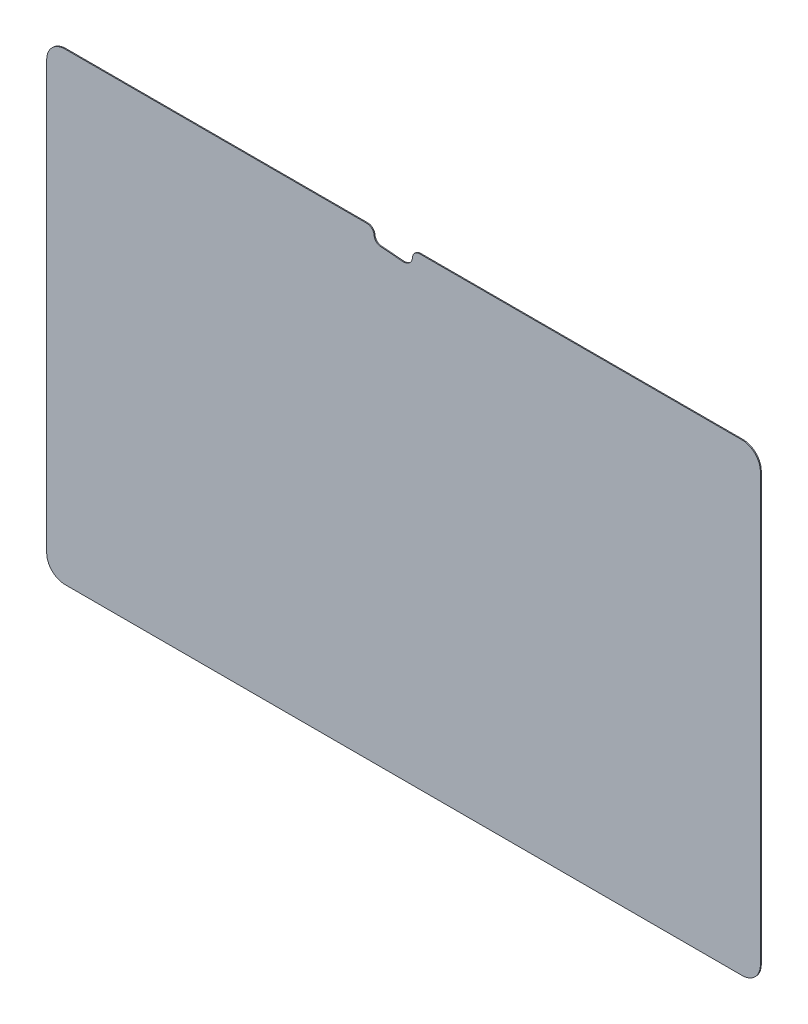
ISO-10303-21;
HEADER;
FILE_DESCRIPTION(('STEP AP214'),'2;1');
FILE_NAME('part.step','',(''),(''),'','','');
FILE_SCHEMA(('AUTOMOTIVE_DESIGN { 1 0 10303 214 1 1 1 1 }'));
ENDSEC;
DATA;
#1=APPLICATION_CONTEXT('core data for automotive mechanical design processes');
#2=APPLICATION_PROTOCOL_DEFINITION('international standard','automotive_design',2000,#1);
#3=PRODUCT_CONTEXT('',#1,'mechanical');
#4=PRODUCT('Part','Part','',(#3));
#5=PRODUCT_RELATED_PRODUCT_CATEGORY('part','',(#4));
#6=PRODUCT_DEFINITION_FORMATION('','',#4);
#7=PRODUCT_DEFINITION_CONTEXT('part definition',#1,'design');
#8=PRODUCT_DEFINITION('design','',#6,#7);
#9=PRODUCT_DEFINITION_SHAPE('','',#8);
#10=(LENGTH_UNIT() NAMED_UNIT(*) SI_UNIT(.MILLI.,.METRE.));
#11=(NAMED_UNIT(*) PLANE_ANGLE_UNIT() SI_UNIT($,.RADIAN.));
#12=(NAMED_UNIT(*) SI_UNIT($,.STERADIAN.) SOLID_ANGLE_UNIT());
#13=UNCERTAINTY_MEASURE_WITH_UNIT(LENGTH_MEASURE(1.E-05),#10,'distance_accuracy_value','');
#14=(GEOMETRIC_REPRESENTATION_CONTEXT(3) GLOBAL_UNCERTAINTY_ASSIGNED_CONTEXT((#13)) GLOBAL_UNIT_ASSIGNED_CONTEXT((#10,
#11,#12)) REPRESENTATION_CONTEXT('',''));
#15=CARTESIAN_POINT('',(0.,0.,0.));
#16=DIRECTION('',(0.,0.,1.));
#17=DIRECTION('',(1.,0.,0.));
#18=AXIS2_PLACEMENT_3D('',#15,#16,#17);
#19=CARTESIAN_POINT('',(126.0094,81.8896,0.3302));
#20=DIRECTION('',(0.,-1.,0.));
#21=DIRECTION('',(1.,0.,0.));
#22=AXIS2_PLACEMENT_3D('',#19,#20,#21);
#23=PLANE('',#22);
#24=DIRECTION('',(-1.,0.,0.));
#25=VECTOR('',#24,1.);
#26=CARTESIAN_POINT('',(126.0094,81.8896,0.));
#27=LINE('',#26,#25);
#28=CARTESIAN_POINT('',(119.5578,81.8896,0.));
#29=VERTEX_POINT('',#28);
#30=CARTESIAN_POINT('',(5.70229044401534,81.8896,0.));
#31=VERTEX_POINT('',#30);
#32=EDGE_CURVE('E172',#29,#31,#27,.T.);
#33=ORIENTED_EDGE('',*,*,#32,.T.);
#34=DIRECTION('',(0.,0.,1.));
#35=VECTOR('',#34,1.);
#36=CARTESIAN_POINT('',(5.70229044401534,81.8896,0.3302));
#37=LINE('',#36,#35);
#38=CARTESIAN_POINT('',(5.70229044401534,81.8896,0.3302));
#39=VERTEX_POINT('',#38);
#40=EDGE_CURVE('E230',#31,#39,#37,.T.);
#41=ORIENTED_EDGE('',*,*,#40,.T.);
#42=DIRECTION('',(-1.,0.,0.));
#43=VECTOR('',#42,1.);
#44=CARTESIAN_POINT('',(126.0094,81.8896,0.3302));
#45=LINE('',#44,#43);
#46=CARTESIAN_POINT('',(119.5578,81.8896,0.3302));
#47=VERTEX_POINT('',#46);
#48=EDGE_CURVE('E179',#47,#39,#45,.T.);
#49=ORIENTED_EDGE('',*,*,#48,.F.);
#50=DIRECTION('',(0.,0.,-1.));
#51=VECTOR('',#50,1.);
#52=CARTESIAN_POINT('',(119.5578,81.8896,0.3302));
#53=LINE('',#52,#51);
#54=EDGE_CURVE('E195',#47,#29,#53,.T.);
#55=ORIENTED_EDGE('',*,*,#54,.T.);
#56=EDGE_LOOP('',(#33,#41,#49,#55));
#57=FACE_BOUND('',#56,.T.);
#58=ADVANCED_FACE('F39',(#57),#23,.F.);
#59=CARTESIAN_POINT('',(-126.0094,-81.8896,0.3302));
#60=DIRECTION('',(1.,0.,0.));
#61=DIRECTION('',(0.,0.,-1.));
#62=AXIS2_PLACEMENT_3D('',#59,#60,#61);
#63=PLANE('',#62);
#64=DIRECTION('',(0.,-1.,0.));
#65=VECTOR('',#64,1.);
#66=CARTESIAN_POINT('',(-126.0094,-81.8896,0.));
#67=LINE('',#66,#65);
#68=CARTESIAN_POINT('',(-126.0094,75.4379999999999,0.));
#69=VERTEX_POINT('',#68);
#70=CARTESIAN_POINT('',(-126.0094,-75.438,0.));
#71=VERTEX_POINT('',#70);
#72=EDGE_CURVE('E166',#69,#71,#67,.T.);
#73=ORIENTED_EDGE('',*,*,#72,.T.);
#74=DIRECTION('',(0.,0.,-1.));
#75=VECTOR('',#74,1.);
#76=CARTESIAN_POINT('',(-126.0094,-75.438,0.3302));
#77=LINE('',#76,#75);
#78=CARTESIAN_POINT('',(-126.0094,-75.438,0.3302));
#79=VERTEX_POINT('',#78);
#80=EDGE_CURVE('E228',#71,#79,#77,.F.);
#81=ORIENTED_EDGE('',*,*,#80,.T.);
#82=DIRECTION('',(0.,-1.,0.));
#83=VECTOR('',#82,1.);
#84=CARTESIAN_POINT('',(-126.0094,-81.8896,0.3302));
#85=LINE('',#84,#83);
#86=CARTESIAN_POINT('',(-126.0094,75.4379999999999,0.3302));
#87=VERTEX_POINT('',#86);
#88=EDGE_CURVE('E168',#87,#79,#85,.T.);
#89=ORIENTED_EDGE('',*,*,#88,.F.);
#90=DIRECTION('',(0.,0.,-1.));
#91=VECTOR('',#90,1.);
#92=CARTESIAN_POINT('',(-126.0094,75.4379999999999,0.3302));
#93=LINE('',#92,#91);
#94=EDGE_CURVE('E225',#87,#69,#93,.T.);
#95=ORIENTED_EDGE('',*,*,#94,.T.);
#96=EDGE_LOOP('',(#73,#81,#89,#95));
#97=FACE_BOUND('',#96,.T.);
#98=ADVANCED_FACE('F269',(#97),#63,.F.);
#99=CARTESIAN_POINT('',(126.0094,-81.8896,0.3302));
#100=DIRECTION('',(0.,1.,0.));
#101=DIRECTION('',(-1.,0.,0.));
#102=AXIS2_PLACEMENT_3D('',#99,#100,#101);
#103=PLANE('',#102);
#104=DIRECTION('',(1.,0.,0.));
#105=VECTOR('',#104,1.);
#106=CARTESIAN_POINT('',(126.0094,-81.8896,0.));
#107=LINE('',#106,#105);
#108=CARTESIAN_POINT('',(-119.5578,-81.8896,0.));
#109=VERTEX_POINT('',#108);
#110=CARTESIAN_POINT('',(119.5578,-81.8896,0.));
#111=VERTEX_POINT('',#110);
#112=EDGE_CURVE('E184',#109,#111,#107,.T.);
#113=ORIENTED_EDGE('',*,*,#112,.T.);
#114=DIRECTION('',(0.,0.,-1.));
#115=VECTOR('',#114,1.);
#116=CARTESIAN_POINT('',(119.5578,-81.8896,0.3302));
#117=LINE('',#116,#115);
#118=CARTESIAN_POINT('',(119.5578,-81.8896,0.3302));
#119=VERTEX_POINT('',#118);
#120=EDGE_CURVE('E223',#111,#119,#117,.F.);
#121=ORIENTED_EDGE('',*,*,#120,.T.);
#122=DIRECTION('',(1.,0.,0.));
#123=VECTOR('',#122,1.);
#124=CARTESIAN_POINT('',(126.0094,-81.8896,0.3302));
#125=LINE('',#124,#123);
#126=CARTESIAN_POINT('',(-119.5578,-81.8896,0.3302));
#127=VERTEX_POINT('',#126);
#128=EDGE_CURVE('E171',#127,#119,#125,.T.);
#129=ORIENTED_EDGE('',*,*,#128,.F.);
#130=DIRECTION('',(0.,0.,-1.));
#131=VECTOR('',#130,1.);
#132=CARTESIAN_POINT('',(-119.5578,-81.8896,0.3302));
#133=LINE('',#132,#131);
#134=EDGE_CURVE('E220',#127,#109,#133,.T.);
#135=ORIENTED_EDGE('',*,*,#134,.T.);
#136=EDGE_LOOP('',(#113,#121,#129,#135));
#137=FACE_BOUND('',#136,.T.);
#138=ADVANCED_FACE('F278',(#137),#103,.F.);
#139=CARTESIAN_POINT('',(126.0094,-81.8896,0.3302));
#140=DIRECTION('',(-1.,0.,0.));
#141=DIRECTION('',(0.,0.,1.));
#142=AXIS2_PLACEMENT_3D('',#139,#140,#141);
#143=PLANE('',#142);
#144=DIRECTION('',(0.,1.,0.));
#145=VECTOR('',#144,1.);
#146=CARTESIAN_POINT('',(126.0094,-81.8896,0.));
#147=LINE('',#146,#145);
#148=CARTESIAN_POINT('',(126.0094,-75.438,0.));
#149=VERTEX_POINT('',#148);
#150=CARTESIAN_POINT('',(126.0094,75.438,0.));
#151=VERTEX_POINT('',#150);
#152=EDGE_CURVE('E187',#149,#151,#147,.T.);
#153=ORIENTED_EDGE('',*,*,#152,.T.);
#154=DIRECTION('',(0.,0.,-1.));
#155=VECTOR('',#154,1.);
#156=CARTESIAN_POINT('',(126.0094,75.438,0.3302));
#157=LINE('',#156,#155);
#158=CARTESIAN_POINT('',(126.0094,75.438,0.3302));
#159=VERTEX_POINT('',#158);
#160=EDGE_CURVE('E210',#151,#159,#157,.F.);
#161=ORIENTED_EDGE('',*,*,#160,.T.);
#162=DIRECTION('',(0.,1.,0.));
#163=VECTOR('',#162,1.);
#164=CARTESIAN_POINT('',(126.0094,-81.8896,0.3302));
#165=LINE('',#164,#163);
#166=CARTESIAN_POINT('',(126.0094,-75.438,0.3302));
#167=VERTEX_POINT('',#166);
#168=EDGE_CURVE('E175',#167,#159,#165,.T.);
#169=ORIENTED_EDGE('',*,*,#168,.F.);
#170=DIRECTION('',(0.,0.,-1.));
#171=VECTOR('',#170,1.);
#172=CARTESIAN_POINT('',(126.0094,-75.438,0.3302));
#173=LINE('',#172,#171);
#174=EDGE_CURVE('E207',#167,#149,#173,.T.);
#175=ORIENTED_EDGE('',*,*,#174,.T.);
#176=EDGE_LOOP('',(#153,#161,#169,#175));
#177=FACE_BOUND('',#176,.T.);
#178=ADVANCED_FACE('F287',(#177),#143,.F.);
#179=CARTESIAN_POINT('',(-12.9396877649237,81.8896,0.3302));
#180=VERTEX_POINT('',#179);
#181=CARTESIAN_POINT('',(-119.5578,81.8895999999999,0.3302));
#182=VERTEX_POINT('',#181);
#183=EDGE_CURVE('E178',#180,#182,#45,.T.);
#184=ORIENTED_EDGE('',*,*,#183,.F.);
#185=DIRECTION('',(0.,0.,1.));
#186=VECTOR('',#185,1.);
#187=CARTESIAN_POINT('',(-12.9396877649237,81.8896,0.3302));
#188=LINE('',#187,#186);
#189=CARTESIAN_POINT('',(-12.9396877649237,81.8896,0.));
#190=VERTEX_POINT('',#189);
#191=EDGE_CURVE('E11',#180,#190,#188,.F.);
#192=ORIENTED_EDGE('',*,*,#191,.T.);
#193=CARTESIAN_POINT('',(-119.5578,81.8895999999999,0.));
#194=VERTEX_POINT('',#193);
#195=EDGE_CURVE('E190',#190,#194,#27,.T.);
#196=ORIENTED_EDGE('',*,*,#195,.T.);
#197=DIRECTION('',(0.,0.,-1.));
#198=VECTOR('',#197,1.);
#199=CARTESIAN_POINT('',(-119.5578,81.8895999999999,0.3302));
#200=LINE('',#199,#198);
#201=EDGE_CURVE('E181',#194,#182,#200,.F.);
#202=ORIENTED_EDGE('',*,*,#201,.T.);
#203=EDGE_LOOP('',(#184,#192,#196,#202));
#204=FACE_BOUND('',#203,.T.);
#205=ADVANCED_FACE('F260',(#204),#23,.F.);
#206=CARTESIAN_POINT('',(0.,0.,0.3302));
#207=DIRECTION('',(0.,0.,1.));
#208=DIRECTION('',(1.,0.,0.));
#209=AXIS2_PLACEMENT_3D('',#206,#207,#208);
#210=PLANE('',#209);
#211=ORIENTED_EDGE('',*,*,#48,.T.);
#212=CARTESIAN_POINT('',(5.70229044401533,79.3496,0.3302));
#213=DIRECTION('',(0.,0.,1.));
#214=DIRECTION('',(1.,0.,0.));
#215=AXIS2_PLACEMENT_3D('',#212,#213,#214);
#216=CIRCLE('',#215,2.54);
#217=CARTESIAN_POINT('',(3.16794117404045,79.5189333333333,0.3302));
#218=VERTEX_POINT('',#217);
#219=EDGE_CURVE('E235',#39,#218,#216,.T.);
#220=ORIENTED_EDGE('',*,*,#219,.T.);
#221=CARTESIAN_POINT('',(4.58657184627953E-06,79.7306,0.3302));
#222=DIRECTION('',(0.,0.,1.));
#223=DIRECTION('',(1.,0.,0.));
#224=AXIS2_PLACEMENT_3D('',#221,#222,#223);
#225=CIRCLE('',#224,3.175);
#226=CARTESIAN_POINT('',(-0.256043800524933,76.5659413733129,0.3302));
#227=VERTEX_POINT('',#226);
#228=EDGE_CURVE('E149',#227,#218,#225,.T.);
#229=ORIENTED_EDGE('',*,*,#228,.F.);
#230=DIRECTION('',(0.996742874547121,-0.0806451612903239,0.));
#231=VECTOR('',#230,1.);
#232=CARTESIAN_POINT('',(-0.256043800524933,76.5659413733129,0.3302));
#233=LINE('',#232,#231);
#234=CARTESIAN_POINT('',(-8.07883412310558,77.1988730986503,0.3302));
#235=VERTEX_POINT('',#234);
#236=EDGE_CURVE('E148',#235,#227,#233,.T.);
#237=ORIENTED_EDGE('',*,*,#236,.F.);
#238=CARTESIAN_POINT('',(-7.87399541342816,79.7306,0.3302));
#239=DIRECTION('',(0.,0.,1.));
#240=DIRECTION('',(1.,0.,0.));
#241=AXIS2_PLACEMENT_3D('',#238,#239,#240);
#242=CIRCLE('',#241,2.54);
#243=CARTESIAN_POINT('',(-10.4068415891759,79.5401,0.3302));
#244=VERTEX_POINT('',#243);
#245=EDGE_CURVE('E141',#244,#235,#242,.T.);
#246=ORIENTED_EDGE('',*,*,#245,.F.);
#247=CARTESIAN_POINT('',(-12.9396877649237,79.3496,0.3302));
#248=DIRECTION('',(0.,0.,1.));
#249=DIRECTION('',(1.,0.,0.));
#250=AXIS2_PLACEMENT_3D('',#247,#248,#249);
#251=CIRCLE('',#250,2.54);
#252=EDGE_CURVE('E233',#244,#180,#251,.T.);
#253=ORIENTED_EDGE('',*,*,#252,.T.);
#254=ORIENTED_EDGE('',*,*,#183,.T.);
#255=CARTESIAN_POINT('',(-119.5578,75.4379999999999,0.3302));
#256=DIRECTION('',(0.,0.,1.));
#257=DIRECTION('',(1.,0.,0.));
#258=AXIS2_PLACEMENT_3D('',#255,#256,#257);
#259=CIRCLE('',#258,6.4516);
#260=EDGE_CURVE('E212',#182,#87,#259,.T.);
#261=ORIENTED_EDGE('',*,*,#260,.T.);
#262=ORIENTED_EDGE('',*,*,#88,.T.);
#263=CARTESIAN_POINT('',(-119.5578,-75.438,0.3302));
#264=DIRECTION('',(0.,0.,1.));
#265=DIRECTION('',(1.,0.,0.));
#266=AXIS2_PLACEMENT_3D('',#263,#264,#265);
#267=CIRCLE('',#266,6.4516);
#268=EDGE_CURVE('E214',#79,#127,#267,.T.);
#269=ORIENTED_EDGE('',*,*,#268,.T.);
#270=ORIENTED_EDGE('',*,*,#128,.T.);
#271=CARTESIAN_POINT('',(119.5578,-75.438,0.3302));
#272=DIRECTION('',(0.,0.,1.));
#273=DIRECTION('',(1.,0.,0.));
#274=AXIS2_PLACEMENT_3D('',#271,#272,#273);
#275=CIRCLE('',#274,6.4516);
#276=EDGE_CURVE('E216',#119,#167,#275,.T.);
#277=ORIENTED_EDGE('',*,*,#276,.T.);
#278=ORIENTED_EDGE('',*,*,#168,.T.);
#279=CARTESIAN_POINT('',(119.5578,75.438,0.3302));
#280=DIRECTION('',(0.,0.,1.));
#281=DIRECTION('',(1.,0.,0.));
#282=AXIS2_PLACEMENT_3D('',#279,#280,#281);
#283=CIRCLE('',#282,6.4516);
#284=EDGE_CURVE('E218',#159,#47,#283,.T.);
#285=ORIENTED_EDGE('',*,*,#284,.T.);
#286=EDGE_LOOP('',(#211,#220,#229,#237,#246,#253,#254,#261,#262,#269,#270,#277,#278,#285));
#287=FACE_BOUND('',#286,.T.);
#288=ADVANCED_FACE('F161',(#287),#210,.T.);
#289=CARTESIAN_POINT('',(0.,0.,0.));
#290=DIRECTION('',(0.,0.,1.));
#291=DIRECTION('',(1.,0.,0.));
#292=AXIS2_PLACEMENT_3D('',#289,#290,#291);
#293=PLANE('',#292);
#294=CARTESIAN_POINT('',(4.58657184627953E-06,79.7306,0.));
#295=DIRECTION('',(0.,0.,1.));
#296=DIRECTION('',(1.,0.,0.));
#297=AXIS2_PLACEMENT_3D('',#294,#295,#296);
#298=CIRCLE('',#297,3.175);
#299=CARTESIAN_POINT('',(3.16794117404045,79.5189333333333,0.));
#300=VERTEX_POINT('',#299);
#301=CARTESIAN_POINT('',(-0.256043800524933,76.5659413733129,0.));
#302=VERTEX_POINT('',#301);
#303=EDGE_CURVE('E245',#300,#302,#298,.F.);
#304=ORIENTED_EDGE('',*,*,#303,.F.);
#305=CARTESIAN_POINT('',(5.70229044401533,79.3496,0.));
#306=DIRECTION('',(0.,0.,1.));
#307=DIRECTION('',(1.,0.,0.));
#308=AXIS2_PLACEMENT_3D('',#305,#306,#307);
#309=CIRCLE('',#308,2.54);
#310=EDGE_CURVE('E240',#300,#31,#309,.F.);
#311=ORIENTED_EDGE('',*,*,#310,.T.);
#312=ORIENTED_EDGE('',*,*,#32,.F.);
#313=CARTESIAN_POINT('',(119.5578,75.438,0.));
#314=DIRECTION('',(0.,0.,1.));
#315=DIRECTION('',(1.,0.,0.));
#316=AXIS2_PLACEMENT_3D('',#313,#314,#315);
#317=CIRCLE('',#316,6.4516);
#318=EDGE_CURVE('E205',#29,#151,#317,.F.);
#319=ORIENTED_EDGE('',*,*,#318,.T.);
#320=ORIENTED_EDGE('',*,*,#152,.F.);
#321=CARTESIAN_POINT('',(119.5578,-75.438,0.));
#322=DIRECTION('',(0.,0.,1.));
#323=DIRECTION('',(1.,0.,0.));
#324=AXIS2_PLACEMENT_3D('',#321,#322,#323);
#325=CIRCLE('',#324,6.4516);
#326=EDGE_CURVE('E203',#149,#111,#325,.F.);
#327=ORIENTED_EDGE('',*,*,#326,.T.);
#328=ORIENTED_EDGE('',*,*,#112,.F.);
#329=CARTESIAN_POINT('',(-119.5578,-75.438,0.));
#330=DIRECTION('',(0.,0.,1.));
#331=DIRECTION('',(1.,0.,0.));
#332=AXIS2_PLACEMENT_3D('',#329,#330,#331);
#333=CIRCLE('',#332,6.4516);
#334=EDGE_CURVE('E201',#109,#71,#333,.F.);
#335=ORIENTED_EDGE('',*,*,#334,.T.);
#336=ORIENTED_EDGE('',*,*,#72,.F.);
#337=CARTESIAN_POINT('',(-119.5578,75.4379999999999,0.));
#338=DIRECTION('',(0.,0.,1.));
#339=DIRECTION('',(1.,0.,0.));
#340=AXIS2_PLACEMENT_3D('',#337,#338,#339);
#341=CIRCLE('',#340,6.4516);
#342=EDGE_CURVE('E198',#69,#194,#341,.F.);
#343=ORIENTED_EDGE('',*,*,#342,.T.);
#344=ORIENTED_EDGE('',*,*,#195,.F.);
#345=CARTESIAN_POINT('',(-12.9396877649237,79.3496,0.));
#346=DIRECTION('',(0.,0.,1.));
#347=DIRECTION('',(1.,0.,0.));
#348=AXIS2_PLACEMENT_3D('',#345,#346,#347);
#349=CIRCLE('',#348,2.54);
#350=CARTESIAN_POINT('',(-10.4068415891759,79.5401,0.));
#351=VERTEX_POINT('',#350);
#352=EDGE_CURVE('E54',#190,#351,#349,.F.);
#353=ORIENTED_EDGE('',*,*,#352,.T.);
#354=CARTESIAN_POINT('',(-7.87399541342816,79.7306,0.));
#355=DIRECTION('',(0.,0.,1.));
#356=DIRECTION('',(1.,0.,0.));
#357=AXIS2_PLACEMENT_3D('',#354,#355,#356);
#358=CIRCLE('',#357,2.54);
#359=CARTESIAN_POINT('',(-8.07883412310558,77.1988730986503,0.));
#360=VERTEX_POINT('',#359);
#361=EDGE_CURVE('E258',#360,#351,#358,.F.);
#362=ORIENTED_EDGE('',*,*,#361,.F.);
#363=DIRECTION('',(-0.996742874547121,0.0806451612903239,0.));
#364=VECTOR('',#363,1.);
#365=CARTESIAN_POINT('',(-0.256043800524933,76.5659413733129,0.));
#366=LINE('',#365,#364);
#367=EDGE_CURVE('E157',#302,#360,#366,.T.);
#368=ORIENTED_EDGE('',*,*,#367,.F.);
#369=EDGE_LOOP('',(#304,#311,#312,#319,#320,#327,#328,#335,#336,#343,#344,#353,#362,#368));
#370=FACE_BOUND('',#369,.T.);
#371=ADVANCED_FACE('F244',(#370),#293,.F.);
#372=CARTESIAN_POINT('',(119.5578,75.438,0.3302));
#373=DIRECTION('',(0.,0.,-1.));
#374=DIRECTION('',(-1.,0.,0.));
#375=AXIS2_PLACEMENT_3D('',#372,#373,#374);
#376=CYLINDRICAL_SURFACE('',#375,6.4516);
#377=ORIENTED_EDGE('',*,*,#284,.F.);
#378=ORIENTED_EDGE('',*,*,#160,.F.);
#379=ORIENTED_EDGE('',*,*,#318,.F.);
#380=ORIENTED_EDGE('',*,*,#54,.F.);
#381=EDGE_LOOP('',(#377,#378,#379,#380));
#382=FACE_BOUND('',#381,.T.);
#383=ADVANCED_FACE('F291',(#382),#376,.T.);
#384=CARTESIAN_POINT('',(119.5578,-75.438,0.3302));
#385=DIRECTION('',(0.,0.,-1.));
#386=DIRECTION('',(-1.,0.,0.));
#387=AXIS2_PLACEMENT_3D('',#384,#385,#386);
#388=CYLINDRICAL_SURFACE('',#387,6.4516);
#389=ORIENTED_EDGE('',*,*,#276,.F.);
#390=ORIENTED_EDGE('',*,*,#120,.F.);
#391=ORIENTED_EDGE('',*,*,#326,.F.);
#392=ORIENTED_EDGE('',*,*,#174,.F.);
#393=EDGE_LOOP('',(#389,#390,#391,#392));
#394=FACE_BOUND('',#393,.T.);
#395=ADVANCED_FACE('F282',(#394),#388,.T.);
#396=CARTESIAN_POINT('',(-119.5578,-75.438,0.3302));
#397=DIRECTION('',(0.,0.,-1.));
#398=DIRECTION('',(-1.,0.,0.));
#399=AXIS2_PLACEMENT_3D('',#396,#397,#398);
#400=CYLINDRICAL_SURFACE('',#399,6.4516);
#401=ORIENTED_EDGE('',*,*,#268,.F.);
#402=ORIENTED_EDGE('',*,*,#80,.F.);
#403=ORIENTED_EDGE('',*,*,#334,.F.);
#404=ORIENTED_EDGE('',*,*,#134,.F.);
#405=EDGE_LOOP('',(#401,#402,#403,#404));
#406=FACE_BOUND('',#405,.T.);
#407=ADVANCED_FACE('F273',(#406),#400,.T.);
#408=CARTESIAN_POINT('',(-119.5578,75.4379999999999,0.3302));
#409=DIRECTION('',(0.,0.,-1.));
#410=DIRECTION('',(-1.,0.,0.));
#411=AXIS2_PLACEMENT_3D('',#408,#409,#410);
#412=CYLINDRICAL_SURFACE('',#411,6.4516);
#413=ORIENTED_EDGE('',*,*,#260,.F.);
#414=ORIENTED_EDGE('',*,*,#201,.F.);
#415=ORIENTED_EDGE('',*,*,#342,.F.);
#416=ORIENTED_EDGE('',*,*,#94,.F.);
#417=EDGE_LOOP('',(#413,#414,#415,#416));
#418=FACE_BOUND('',#417,.T.);
#419=ADVANCED_FACE('F265',(#418),#412,.T.);
#420=CARTESIAN_POINT('',(4.58657184627953E-06,79.7306,-0.00100000000000002));
#421=DIRECTION('',(0.,0.,1.));
#422=DIRECTION('',(1.,0.,0.));
#423=AXIS2_PLACEMENT_3D('',#420,#421,#422);
#424=CYLINDRICAL_SURFACE('',#423,3.175);
#425=ORIENTED_EDGE('',*,*,#228,.T.);
#426=DIRECTION('',(0.,0.,1.));
#427=VECTOR('',#426,1.);
#428=CARTESIAN_POINT('',(3.16794117404045,79.5189333333333,-0.00100000000000002));
#429=LINE('',#428,#427);
#430=EDGE_CURVE('E237',#218,#300,#429,.F.);
#431=ORIENTED_EDGE('',*,*,#430,.T.);
#432=ORIENTED_EDGE('',*,*,#303,.T.);
#433=DIRECTION('',(0.,0.,1.));
#434=VECTOR('',#433,1.);
#435=CARTESIAN_POINT('',(-0.256043800524933,76.5659413733129,-0.00100000000000002));
#436=LINE('',#435,#434);
#437=EDGE_CURVE('E158',#302,#227,#436,.T.);
#438=ORIENTED_EDGE('',*,*,#437,.T.);
#439=EDGE_LOOP('',(#425,#431,#432,#438));
#440=FACE_BOUND('',#439,.T.);
#441=ADVANCED_FACE('F254',(#440),#424,.F.);
#442=CARTESIAN_POINT('',(-0.256043800524933,76.5659413733129,-0.00100000000000002));
#443=DIRECTION('',(-0.0806451612903239,-0.996742874547121,0.));
#444=DIRECTION('',(0.996742874547121,-0.0806451612903239,0.));
#445=AXIS2_PLACEMENT_3D('',#442,#443,#444);
#446=PLANE('',#445);
#447=ORIENTED_EDGE('',*,*,#367,.T.);
#448=DIRECTION('',(0.,0.,1.));
#449=VECTOR('',#448,1.);
#450=CARTESIAN_POINT('',(-8.07883412310558,77.1988730986503,-0.00100000000000002));
#451=LINE('',#450,#449);
#452=EDGE_CURVE('E144',#360,#235,#451,.T.);
#453=ORIENTED_EDGE('',*,*,#452,.T.);
#454=ORIENTED_EDGE('',*,*,#236,.T.);
#455=ORIENTED_EDGE('',*,*,#437,.F.);
#456=EDGE_LOOP('',(#447,#453,#454,#455));
#457=FACE_BOUND('',#456,.T.);
#458=ADVANCED_FACE('F153',(#457),#446,.F.);
#459=CARTESIAN_POINT('',(-7.87399541342816,79.7306,-0.00100000000000002));
#460=DIRECTION('',(0.,0.,1.));
#461=DIRECTION('',(1.,0.,0.));
#462=AXIS2_PLACEMENT_3D('',#459,#460,#461);
#463=CYLINDRICAL_SURFACE('',#462,2.54);
#464=ORIENTED_EDGE('',*,*,#361,.T.);
#465=DIRECTION('',(0.,0.,1.));
#466=VECTOR('',#465,1.);
#467=CARTESIAN_POINT('',(-10.4068415891759,79.5401,-0.00100000000000002));
#468=LINE('',#467,#466);
#469=EDGE_CURVE('E47',#351,#244,#468,.T.);
#470=ORIENTED_EDGE('',*,*,#469,.T.);
#471=ORIENTED_EDGE('',*,*,#245,.T.);
#472=ORIENTED_EDGE('',*,*,#452,.F.);
#473=EDGE_LOOP('',(#464,#470,#471,#472));
#474=FACE_BOUND('',#473,.T.);
#475=ADVANCED_FACE('F143',(#474),#463,.F.);
#476=CARTESIAN_POINT('',(5.70229044401533,79.3496,-0.00100000000000002));
#477=DIRECTION('',(0.,0.,1.));
#478=DIRECTION('',(1.,0.,0.));
#479=AXIS2_PLACEMENT_3D('',#476,#477,#478);
#480=CYLINDRICAL_SURFACE('',#479,2.54);
#481=ORIENTED_EDGE('',*,*,#310,.F.);
#482=ORIENTED_EDGE('',*,*,#430,.F.);
#483=ORIENTED_EDGE('',*,*,#219,.F.);
#484=ORIENTED_EDGE('',*,*,#40,.F.);
#485=EDGE_LOOP('',(#481,#482,#483,#484));
#486=FACE_BOUND('',#485,.T.);
#487=ADVANCED_FACE('F252',(#486),#480,.T.);
#488=CARTESIAN_POINT('',(-12.9396877649237,79.3496,-0.00100000000000002));
#489=DIRECTION('',(0.,0.,1.));
#490=DIRECTION('',(1.,0.,0.));
#491=AXIS2_PLACEMENT_3D('',#488,#489,#490);
#492=CYLINDRICAL_SURFACE('',#491,2.54);
#493=ORIENTED_EDGE('',*,*,#352,.F.);
#494=ORIENTED_EDGE('',*,*,#191,.F.);
#495=ORIENTED_EDGE('',*,*,#252,.F.);
#496=ORIENTED_EDGE('',*,*,#469,.F.);
#497=EDGE_LOOP('',(#493,#494,#495,#496));
#498=FACE_BOUND('',#497,.T.);
#499=ADVANCED_FACE('F41',(#498),#492,.T.);
#500=CLOSED_SHELL('',(#58,#98,#138,#178,#205,#288,#371,#383,#395,#407,#419,#441,#458,#475,#487,#499));
#501=MANIFOLD_SOLID_BREP('B2',#500);
#502=ADVANCED_BREP_SHAPE_REPRESENTATION('',(#18,#501),#14);
#503=SHAPE_DEFINITION_REPRESENTATION(#9,#502);
ENDSEC;
END-ISO-10303-21;
